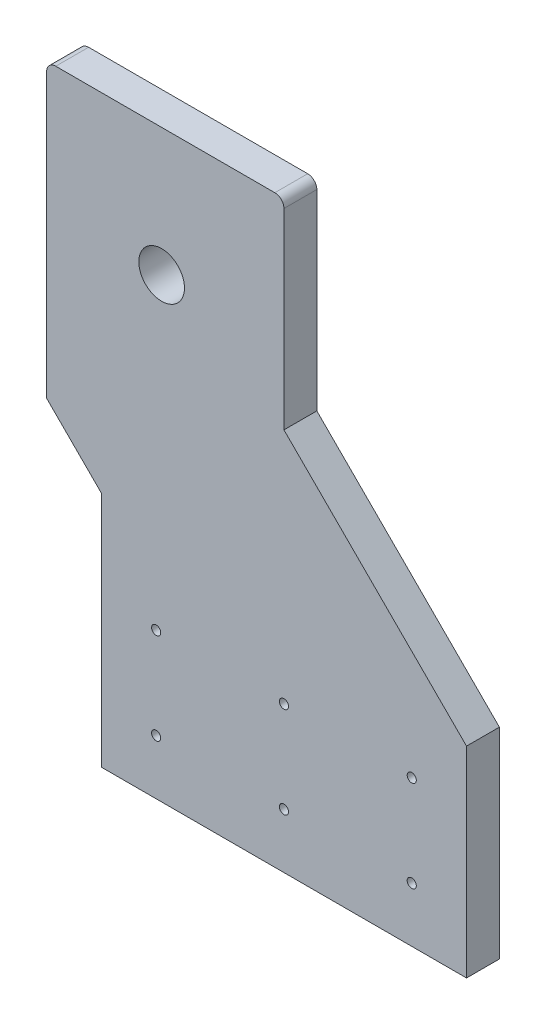
ISO-10303-21;
HEADER;
FILE_DESCRIPTION(('STEP AP214'),'2;1');
FILE_NAME('part.step','',(''),(''),'','','');
FILE_SCHEMA(('AUTOMOTIVE_DESIGN { 1 0 10303 214 1 1 1 1 }'));
ENDSEC;
DATA;
#1=APPLICATION_CONTEXT('core data for automotive mechanical design processes');
#2=APPLICATION_PROTOCOL_DEFINITION('international standard','automotive_design',2000,#1);
#3=PRODUCT_CONTEXT('',#1,'mechanical');
#4=PRODUCT('Part','Part','',(#3));
#5=PRODUCT_RELATED_PRODUCT_CATEGORY('part','',(#4));
#6=PRODUCT_DEFINITION_FORMATION('','',#4);
#7=PRODUCT_DEFINITION_CONTEXT('part definition',#1,'design');
#8=PRODUCT_DEFINITION('design','',#6,#7);
#9=PRODUCT_DEFINITION_SHAPE('','',#8);
#10=(LENGTH_UNIT() NAMED_UNIT(*) SI_UNIT(.MILLI.,.METRE.));
#11=(NAMED_UNIT(*) PLANE_ANGLE_UNIT() SI_UNIT($,.RADIAN.));
#12=(NAMED_UNIT(*) SI_UNIT($,.STERADIAN.) SOLID_ANGLE_UNIT());
#13=UNCERTAINTY_MEASURE_WITH_UNIT(LENGTH_MEASURE(1.E-05),#10,'distance_accuracy_value','');
#14=(GEOMETRIC_REPRESENTATION_CONTEXT(3) GLOBAL_UNCERTAINTY_ASSIGNED_CONTEXT((#13)) GLOBAL_UNIT_ASSIGNED_CONTEXT((#10,
#11,#12)) REPRESENTATION_CONTEXT('',''));
#15=CARTESIAN_POINT('',(0.,0.,0.));
#16=DIRECTION('',(0.,0.,1.));
#17=DIRECTION('',(1.,0.,0.));
#18=AXIS2_PLACEMENT_3D('',#15,#16,#17);
#19=CARTESIAN_POINT('',(-120.929818016854,148.487708826966,18.));
#20=DIRECTION('',(0.,0.,1.));
#21=DIRECTION('',(1.,0.,0.));
#22=AXIS2_PLACEMENT_3D('',#19,#20,#21);
#23=PLANE('',#22);
#24=CARTESIAN_POINT('',(74.070181983146,-86.5122911730335,18.));
#25=DIRECTION('',(0.,0.,1.));
#26=DIRECTION('',(1.,0.,0.));
#27=AXIS2_PLACEMENT_3D('',#24,#25,#26);
#28=CIRCLE('',#27,2.5);
#29=CARTESIAN_POINT('',(76.570181983146,-86.5122911730335,18.));
#30=VERTEX_POINT('',#29);
#31=EDGE_CURVE('E247',#30,#30,#28,.T.);
#32=ORIENTED_EDGE('',*,*,#31,.F.);
#33=EDGE_LOOP('',(#32));
#34=FACE_BOUND('',#33,.T.);
#35=CARTESIAN_POINT('',(74.070181983146,-136.512291173034,18.));
#36=DIRECTION('',(0.,0.,1.));
#37=DIRECTION('',(1.,0.,0.));
#38=AXIS2_PLACEMENT_3D('',#35,#36,#37);
#39=CIRCLE('',#38,2.5);
#40=CARTESIAN_POINT('',(76.570181983146,-136.512291173034,18.));
#41=VERTEX_POINT('',#40);
#42=EDGE_CURVE('E241',#41,#41,#39,.T.);
#43=ORIENTED_EDGE('',*,*,#42,.F.);
#44=EDGE_LOOP('',(#43));
#45=FACE_BOUND('',#44,.T.);
#46=CARTESIAN_POINT('',(4.07018198314597,-136.512291173034,18.));
#47=DIRECTION('',(0.,0.,1.));
#48=DIRECTION('',(1.,0.,0.));
#49=AXIS2_PLACEMENT_3D('',#46,#47,#48);
#50=CIRCLE('',#49,2.5);
#51=CARTESIAN_POINT('',(6.57018198314597,-136.512291173034,18.));
#52=VERTEX_POINT('',#51);
#53=EDGE_CURVE('E235',#52,#52,#50,.T.);
#54=ORIENTED_EDGE('',*,*,#53,.F.);
#55=EDGE_LOOP('',(#54));
#56=FACE_BOUND('',#55,.T.);
#57=CARTESIAN_POINT('',(-65.929818016854,-136.512291173034,18.));
#58=DIRECTION('',(0.,0.,1.));
#59=DIRECTION('',(1.,0.,0.));
#60=AXIS2_PLACEMENT_3D('',#57,#58,#59);
#61=CIRCLE('',#60,2.5);
#62=CARTESIAN_POINT('',(-63.429818016854,-136.512291173034,18.));
#63=VERTEX_POINT('',#62);
#64=EDGE_CURVE('E229',#63,#63,#61,.T.);
#65=ORIENTED_EDGE('',*,*,#64,.F.);
#66=EDGE_LOOP('',(#65));
#67=FACE_BOUND('',#66,.T.);
#68=CARTESIAN_POINT('',(-65.929818016854,-86.5122911730335,18.));
#69=DIRECTION('',(0.,0.,1.));
#70=DIRECTION('',(1.,0.,0.));
#71=AXIS2_PLACEMENT_3D('',#68,#69,#70);
#72=CIRCLE('',#71,2.5);
#73=CARTESIAN_POINT('',(-63.429818016854,-86.5122911730335,18.));
#74=VERTEX_POINT('',#73);
#75=EDGE_CURVE('E223',#74,#74,#72,.T.);
#76=ORIENTED_EDGE('',*,*,#75,.F.);
#77=EDGE_LOOP('',(#76));
#78=FACE_BOUND('',#77,.T.);
#79=CARTESIAN_POINT('',(4.07018198314597,-86.5122911730335,18.));
#80=DIRECTION('',(0.,0.,1.));
#81=DIRECTION('',(1.,0.,0.));
#82=AXIS2_PLACEMENT_3D('',#79,#80,#81);
#83=CIRCLE('',#82,2.5);
#84=CARTESIAN_POINT('',(6.57018198314597,-86.5122911730335,18.));
#85=VERTEX_POINT('',#84);
#86=EDGE_CURVE('E217',#85,#85,#83,.T.);
#87=ORIENTED_EDGE('',*,*,#86,.F.);
#88=EDGE_LOOP('',(#87));
#89=FACE_BOUND('',#88,.T.);
#90=DIRECTION('',(0.,1.,0.));
#91=VECTOR('',#90,1.);
#92=CARTESIAN_POINT('',(104.070181983146,-56.5122911730335,18.));
#93=LINE('',#92,#91);
#94=CARTESIAN_POINT('',(104.070181983146,-166.512291173034,18.));
#95=VERTEX_POINT('',#94);
#96=CARTESIAN_POINT('',(104.070181983146,-56.5122911730335,18.));
#97=VERTEX_POINT('',#96);
#98=EDGE_CURVE('E162',#95,#97,#93,.T.);
#99=ORIENTED_EDGE('',*,*,#98,.T.);
#100=DIRECTION('',(-0.707106781186547,0.707106781186547,0.));
#101=VECTOR('',#100,1.);
#102=CARTESIAN_POINT('',(4.07018198314597,43.4877088269665,18.));
#103=LINE('',#102,#101);
#104=CARTESIAN_POINT('',(4.07018198314597,43.4877088269665,18.));
#105=VERTEX_POINT('',#104);
#106=EDGE_CURVE('E99',#97,#105,#103,.T.);
#107=ORIENTED_EDGE('',*,*,#106,.T.);
#108=DIRECTION('',(0.,1.,0.));
#109=VECTOR('',#108,1.);
#110=CARTESIAN_POINT('',(4.07018198314596,148.487708826966,18.));
#111=LINE('',#110,#109);
#112=CARTESIAN_POINT('',(4.07018198314596,148.487708826966,18.));
#113=VERTEX_POINT('',#112);
#114=EDGE_CURVE('E183',#105,#113,#111,.T.);
#115=ORIENTED_EDGE('',*,*,#114,.T.);
#116=CARTESIAN_POINT('',(-0.929818016854045,148.487708826966,18.));
#117=DIRECTION('',(0.,0.,1.));
#118=DIRECTION('',(1.,0.,0.));
#119=AXIS2_PLACEMENT_3D('',#116,#117,#118);
#120=CIRCLE('',#119,5.);
#121=CARTESIAN_POINT('',(-0.929818016854045,153.487708826966,18.));
#122=VERTEX_POINT('',#121);
#123=EDGE_CURVE('E201',#113,#122,#120,.T.);
#124=ORIENTED_EDGE('',*,*,#123,.T.);
#125=DIRECTION('',(-1.,0.,0.));
#126=VECTOR('',#125,1.);
#127=CARTESIAN_POINT('',(-95.9298180168541,153.487708826966,18.));
#128=LINE('',#127,#126);
#129=CARTESIAN_POINT('',(-120.929818016854,153.487708826966,18.));
#130=VERTEX_POINT('',#129);
#131=EDGE_CURVE('E198',#122,#130,#128,.T.);
#132=ORIENTED_EDGE('',*,*,#131,.T.);
#133=CARTESIAN_POINT('',(-120.929818016854,148.487708826966,18.));
#134=DIRECTION('',(0.,0.,1.));
#135=DIRECTION('',(1.,0.,0.));
#136=AXIS2_PLACEMENT_3D('',#133,#134,#135);
#137=CIRCLE('',#136,5.);
#138=CARTESIAN_POINT('',(-125.929818016854,148.487708826966,18.));
#139=VERTEX_POINT('',#138);
#140=EDGE_CURVE('E200',#130,#139,#137,.T.);
#141=ORIENTED_EDGE('',*,*,#140,.T.);
#142=DIRECTION('',(0.,-1.,0.));
#143=VECTOR('',#142,1.);
#144=CARTESIAN_POINT('',(-125.929818016854,148.487708826966,18.));
#145=LINE('',#144,#143);
#146=CARTESIAN_POINT('',(-125.929818016854,-6.51229117303351,18.));
#147=VERTEX_POINT('',#146);
#148=EDGE_CURVE('E124',#139,#147,#145,.T.);
#149=ORIENTED_EDGE('',*,*,#148,.T.);
#150=DIRECTION('',(0.707106781186547,-0.707106781186548,0.));
#151=VECTOR('',#150,1.);
#152=CARTESIAN_POINT('',(-125.929818016854,-6.51229117303351,18.));
#153=LINE('',#152,#151);
#154=CARTESIAN_POINT('',(-95.929818016854,-36.5122911730335,18.));
#155=VERTEX_POINT('',#154);
#156=EDGE_CURVE('E118',#147,#155,#153,.T.);
#157=ORIENTED_EDGE('',*,*,#156,.T.);
#158=DIRECTION('',(0.,-1.,0.));
#159=VECTOR('',#158,1.);
#160=CARTESIAN_POINT('',(-95.929818016854,-36.5122911730335,18.));
#161=LINE('',#160,#159);
#162=CARTESIAN_POINT('',(-95.929818016854,-166.512291173034,18.));
#163=VERTEX_POINT('',#162);
#164=EDGE_CURVE('E122',#155,#163,#161,.T.);
#165=ORIENTED_EDGE('',*,*,#164,.T.);
#166=DIRECTION('',(1.,0.,0.));
#167=VECTOR('',#166,1.);
#168=CARTESIAN_POINT('',(-95.929818016854,-166.512291173034,18.));
#169=LINE('',#168,#167);
#170=EDGE_CURVE('E50',#163,#95,#169,.T.);
#171=ORIENTED_EDGE('',*,*,#170,.T.);
#172=EDGE_LOOP('',(#99,#107,#115,#124,#132,#141,#149,#157,#165,#171));
#173=FACE_BOUND('',#172,.T.);
#174=CARTESIAN_POINT('',(-62.929818016854,83.4877088269665,18.));
#175=DIRECTION('',(0.,0.,1.));
#176=DIRECTION('',(1.,0.,0.));
#177=AXIS2_PLACEMENT_3D('',#174,#175,#176);
#178=CIRCLE('',#177,12.5);
#179=CARTESIAN_POINT('',(-50.429818016854,83.4877088269665,18.));
#180=VERTEX_POINT('',#179);
#181=EDGE_CURVE('E146',#180,#180,#178,.T.);
#182=ORIENTED_EDGE('',*,*,#181,.F.);
#183=EDGE_LOOP('',(#182));
#184=FACE_BOUND('',#183,.T.);
#185=ADVANCED_FACE('F33',(#34,#45,#56,#67,#78,#89,#173,#184),#23,.T.);
#186=CARTESIAN_POINT('',(-120.929818016854,148.487708826966,0.));
#187=DIRECTION('',(0.,0.,1.));
#188=DIRECTION('',(1.,0.,0.));
#189=AXIS2_PLACEMENT_3D('',#186,#187,#188);
#190=PLANE('',#189);
#191=CARTESIAN_POINT('',(74.070181983146,-86.5122911730335,0.));
#192=DIRECTION('',(0.,0.,1.));
#193=DIRECTION('',(1.,0.,0.));
#194=AXIS2_PLACEMENT_3D('',#191,#192,#193);
#195=CIRCLE('',#194,2.5);
#196=CARTESIAN_POINT('',(76.570181983146,-86.5122911730335,0.));
#197=VERTEX_POINT('',#196);
#198=EDGE_CURVE('E244',#197,#197,#195,.T.);
#199=ORIENTED_EDGE('',*,*,#198,.T.);
#200=EDGE_LOOP('',(#199));
#201=FACE_BOUND('',#200,.T.);
#202=CARTESIAN_POINT('',(74.070181983146,-136.512291173034,0.));
#203=DIRECTION('',(0.,0.,1.));
#204=DIRECTION('',(1.,0.,0.));
#205=AXIS2_PLACEMENT_3D('',#202,#203,#204);
#206=CIRCLE('',#205,2.5);
#207=CARTESIAN_POINT('',(76.570181983146,-136.512291173034,0.));
#208=VERTEX_POINT('',#207);
#209=EDGE_CURVE('E238',#208,#208,#206,.T.);
#210=ORIENTED_EDGE('',*,*,#209,.T.);
#211=EDGE_LOOP('',(#210));
#212=FACE_BOUND('',#211,.T.);
#213=CARTESIAN_POINT('',(4.07018198314597,-136.512291173034,0.));
#214=DIRECTION('',(0.,0.,1.));
#215=DIRECTION('',(1.,0.,0.));
#216=AXIS2_PLACEMENT_3D('',#213,#214,#215);
#217=CIRCLE('',#216,2.5);
#218=CARTESIAN_POINT('',(6.57018198314597,-136.512291173034,0.));
#219=VERTEX_POINT('',#218);
#220=EDGE_CURVE('E232',#219,#219,#217,.T.);
#221=ORIENTED_EDGE('',*,*,#220,.T.);
#222=EDGE_LOOP('',(#221));
#223=FACE_BOUND('',#222,.T.);
#224=CARTESIAN_POINT('',(-65.929818016854,-136.512291173034,0.));
#225=DIRECTION('',(0.,0.,1.));
#226=DIRECTION('',(1.,0.,0.));
#227=AXIS2_PLACEMENT_3D('',#224,#225,#226);
#228=CIRCLE('',#227,2.5);
#229=CARTESIAN_POINT('',(-63.429818016854,-136.512291173034,0.));
#230=VERTEX_POINT('',#229);
#231=EDGE_CURVE('E226',#230,#230,#228,.T.);
#232=ORIENTED_EDGE('',*,*,#231,.T.);
#233=EDGE_LOOP('',(#232));
#234=FACE_BOUND('',#233,.T.);
#235=CARTESIAN_POINT('',(-65.929818016854,-86.5122911730335,0.));
#236=DIRECTION('',(0.,0.,1.));
#237=DIRECTION('',(1.,0.,0.));
#238=AXIS2_PLACEMENT_3D('',#235,#236,#237);
#239=CIRCLE('',#238,2.5);
#240=CARTESIAN_POINT('',(-63.429818016854,-86.5122911730335,0.));
#241=VERTEX_POINT('',#240);
#242=EDGE_CURVE('E220',#241,#241,#239,.T.);
#243=ORIENTED_EDGE('',*,*,#242,.T.);
#244=EDGE_LOOP('',(#243));
#245=FACE_BOUND('',#244,.T.);
#246=CARTESIAN_POINT('',(4.07018198314597,-86.5122911730335,0.));
#247=DIRECTION('',(0.,0.,1.));
#248=DIRECTION('',(1.,0.,0.));
#249=AXIS2_PLACEMENT_3D('',#246,#247,#248);
#250=CIRCLE('',#249,2.5);
#251=CARTESIAN_POINT('',(6.57018198314597,-86.5122911730335,0.));
#252=VERTEX_POINT('',#251);
#253=EDGE_CURVE('E212',#252,#252,#250,.T.);
#254=ORIENTED_EDGE('',*,*,#253,.T.);
#255=EDGE_LOOP('',(#254));
#256=FACE_BOUND('',#255,.T.);
#257=DIRECTION('',(0.,1.,0.));
#258=VECTOR('',#257,1.);
#259=CARTESIAN_POINT('',(104.070181983146,-56.5122911730335,0.));
#260=LINE('',#259,#258);
#261=CARTESIAN_POINT('',(104.070181983146,-166.512291173034,0.));
#262=VERTEX_POINT('',#261);
#263=CARTESIAN_POINT('',(104.070181983146,-56.5122911730335,0.));
#264=VERTEX_POINT('',#263);
#265=EDGE_CURVE('E142',#262,#264,#260,.T.);
#266=ORIENTED_EDGE('',*,*,#265,.F.);
#267=DIRECTION('',(1.,0.,0.));
#268=VECTOR('',#267,1.);
#269=CARTESIAN_POINT('',(-95.929818016854,-166.512291173034,0.));
#270=LINE('',#269,#268);
#271=CARTESIAN_POINT('',(-95.929818016854,-166.512291173034,0.));
#272=VERTEX_POINT('',#271);
#273=EDGE_CURVE('E91',#272,#262,#270,.T.);
#274=ORIENTED_EDGE('',*,*,#273,.F.);
#275=DIRECTION('',(0.,-1.,0.));
#276=VECTOR('',#275,1.);
#277=CARTESIAN_POINT('',(-95.929818016854,-36.5122911730335,0.));
#278=LINE('',#277,#276);
#279=CARTESIAN_POINT('',(-95.929818016854,-36.5122911730335,0.));
#280=VERTEX_POINT('',#279);
#281=EDGE_CURVE('E85',#280,#272,#278,.T.);
#282=ORIENTED_EDGE('',*,*,#281,.F.);
#283=DIRECTION('',(0.707106781186547,-0.707106781186548,0.));
#284=VECTOR('',#283,1.);
#285=CARTESIAN_POINT('',(-125.929818016854,-6.51229117303351,0.));
#286=LINE('',#285,#284);
#287=CARTESIAN_POINT('',(-125.929818016854,-6.51229117303351,0.));
#288=VERTEX_POINT('',#287);
#289=EDGE_CURVE('E132',#288,#280,#286,.T.);
#290=ORIENTED_EDGE('',*,*,#289,.F.);
#291=DIRECTION('',(0.,-1.,0.));
#292=VECTOR('',#291,1.);
#293=CARTESIAN_POINT('',(-125.929818016854,148.487708826966,0.));
#294=LINE('',#293,#292);
#295=CARTESIAN_POINT('',(-125.929818016854,148.487708826966,0.));
#296=VERTEX_POINT('',#295);
#297=EDGE_CURVE('E157',#296,#288,#294,.T.);
#298=ORIENTED_EDGE('',*,*,#297,.F.);
#299=CARTESIAN_POINT('',(-120.929818016854,148.487708826966,0.));
#300=DIRECTION('',(0.,0.,1.));
#301=DIRECTION('',(1.,0.,0.));
#302=AXIS2_PLACEMENT_3D('',#299,#300,#301);
#303=CIRCLE('',#302,5.);
#304=CARTESIAN_POINT('',(-120.929818016854,153.487708826966,0.));
#305=VERTEX_POINT('',#304);
#306=EDGE_CURVE('E155',#305,#296,#303,.T.);
#307=ORIENTED_EDGE('',*,*,#306,.F.);
#308=DIRECTION('',(-1.,0.,0.));
#309=VECTOR('',#308,1.);
#310=CARTESIAN_POINT('',(-95.9298180168541,153.487708826966,0.));
#311=LINE('',#310,#309);
#312=CARTESIAN_POINT('',(-0.929818016854045,153.487708826966,0.));
#313=VERTEX_POINT('',#312);
#314=EDGE_CURVE('E153',#313,#305,#311,.T.);
#315=ORIENTED_EDGE('',*,*,#314,.F.);
#316=CARTESIAN_POINT('',(-0.929818016854045,148.487708826966,0.));
#317=DIRECTION('',(0.,0.,1.));
#318=DIRECTION('',(1.,0.,0.));
#319=AXIS2_PLACEMENT_3D('',#316,#317,#318);
#320=CIRCLE('',#319,5.);
#321=CARTESIAN_POINT('',(4.07018198314596,148.487708826966,0.));
#322=VERTEX_POINT('',#321);
#323=EDGE_CURVE('E150',#322,#313,#320,.T.);
#324=ORIENTED_EDGE('',*,*,#323,.F.);
#325=DIRECTION('',(0.,1.,0.));
#326=VECTOR('',#325,1.);
#327=CARTESIAN_POINT('',(4.07018198314596,148.487708826966,0.));
#328=LINE('',#327,#326);
#329=CARTESIAN_POINT('',(4.07018198314597,43.4877088269665,0.));
#330=VERTEX_POINT('',#329);
#331=EDGE_CURVE('E148',#330,#322,#328,.T.);
#332=ORIENTED_EDGE('',*,*,#331,.F.);
#333=DIRECTION('',(-0.707106781186547,0.707106781186547,0.));
#334=VECTOR('',#333,1.);
#335=CARTESIAN_POINT('',(4.07018198314597,43.4877088269665,0.));
#336=LINE('',#335,#334);
#337=EDGE_CURVE('E145',#264,#330,#336,.T.);
#338=ORIENTED_EDGE('',*,*,#337,.F.);
#339=EDGE_LOOP('',(#266,#274,#282,#290,#298,#307,#315,#324,#332,#338));
#340=FACE_BOUND('',#339,.T.);
#341=CARTESIAN_POINT('',(-62.929818016854,83.4877088269665,0.));
#342=DIRECTION('',(0.,0.,1.));
#343=DIRECTION('',(1.,0.,0.));
#344=AXIS2_PLACEMENT_3D('',#341,#342,#343);
#345=CIRCLE('',#344,12.5);
#346=CARTESIAN_POINT('',(-50.429818016854,83.4877088269665,0.));
#347=VERTEX_POINT('',#346);
#348=EDGE_CURVE('E209',#347,#347,#345,.T.);
#349=ORIENTED_EDGE('',*,*,#348,.T.);
#350=EDGE_LOOP('',(#349));
#351=FACE_BOUND('',#350,.T.);
#352=ADVANCED_FACE('F187',(#201,#212,#223,#234,#245,#256,#340,#351),#190,.F.);
#353=CARTESIAN_POINT('',(104.070181983146,-56.5122911730335,18.));
#354=DIRECTION('',(-1.,0.,0.));
#355=DIRECTION('',(0.,0.,1.));
#356=AXIS2_PLACEMENT_3D('',#353,#354,#355);
#357=PLANE('',#356);
#358=ORIENTED_EDGE('',*,*,#265,.T.);
#359=DIRECTION('',(0.,0.,-1.));
#360=VECTOR('',#359,1.);
#361=CARTESIAN_POINT('',(104.070181983146,-56.5122911730335,18.));
#362=LINE('',#361,#360);
#363=EDGE_CURVE('E11',#97,#264,#362,.T.);
#364=ORIENTED_EDGE('',*,*,#363,.F.);
#365=ORIENTED_EDGE('',*,*,#98,.F.);
#366=DIRECTION('',(0.,0.,-1.));
#367=VECTOR('',#366,1.);
#368=CARTESIAN_POINT('',(104.070181983146,-166.512291173034,18.));
#369=LINE('',#368,#367);
#370=EDGE_CURVE('E138',#95,#262,#369,.T.);
#371=ORIENTED_EDGE('',*,*,#370,.T.);
#372=EDGE_LOOP('',(#358,#364,#365,#371));
#373=FACE_BOUND('',#372,.T.);
#374=ADVANCED_FACE('F35',(#373),#357,.F.);
#375=CARTESIAN_POINT('',(4.07018198314597,43.4877088269665,18.));
#376=DIRECTION('',(-0.707106781186547,-0.707106781186547,0.));
#377=DIRECTION('',(0.707106781186548,-0.707106781186548,0.));
#378=AXIS2_PLACEMENT_3D('',#375,#376,#377);
#379=PLANE('',#378);
#380=ORIENTED_EDGE('',*,*,#337,.T.);
#381=DIRECTION('',(0.,0.,-1.));
#382=VECTOR('',#381,1.);
#383=CARTESIAN_POINT('',(4.07018198314597,43.4877088269665,18.));
#384=LINE('',#383,#382);
#385=EDGE_CURVE('E42',#105,#330,#384,.T.);
#386=ORIENTED_EDGE('',*,*,#385,.F.);
#387=ORIENTED_EDGE('',*,*,#106,.F.);
#388=ORIENTED_EDGE('',*,*,#363,.T.);
#389=EDGE_LOOP('',(#380,#386,#387,#388));
#390=FACE_BOUND('',#389,.T.);
#391=ADVANCED_FACE('F307',(#390),#379,.F.);
#392=CARTESIAN_POINT('',(4.07018198314596,148.487708826966,18.));
#393=DIRECTION('',(-1.,0.,0.));
#394=DIRECTION('',(0.,-1.,0.));
#395=AXIS2_PLACEMENT_3D('',#392,#393,#394);
#396=PLANE('',#395);
#397=ORIENTED_EDGE('',*,*,#331,.T.);
#398=DIRECTION('',(0.,0.,-1.));
#399=VECTOR('',#398,1.);
#400=CARTESIAN_POINT('',(4.07018198314596,148.487708826966,18.));
#401=LINE('',#400,#399);
#402=EDGE_CURVE('E175',#113,#322,#401,.T.);
#403=ORIENTED_EDGE('',*,*,#402,.F.);
#404=ORIENTED_EDGE('',*,*,#114,.F.);
#405=ORIENTED_EDGE('',*,*,#385,.T.);
#406=EDGE_LOOP('',(#397,#403,#404,#405));
#407=FACE_BOUND('',#406,.T.);
#408=ADVANCED_FACE('F181',(#407),#396,.F.);
#409=CARTESIAN_POINT('',(-0.929818016854045,148.487708826966,18.));
#410=DIRECTION('',(0.,0.,-1.));
#411=DIRECTION('',(-1.,0.,0.));
#412=AXIS2_PLACEMENT_3D('',#409,#410,#411);
#413=CYLINDRICAL_SURFACE('',#412,5.);
#414=ORIENTED_EDGE('',*,*,#323,.T.);
#415=DIRECTION('',(0.,0.,-1.));
#416=VECTOR('',#415,1.);
#417=CARTESIAN_POINT('',(-0.929818016854045,153.487708826966,18.));
#418=LINE('',#417,#416);
#419=EDGE_CURVE('E172',#122,#313,#418,.T.);
#420=ORIENTED_EDGE('',*,*,#419,.F.);
#421=ORIENTED_EDGE('',*,*,#123,.F.);
#422=ORIENTED_EDGE('',*,*,#402,.T.);
#423=EDGE_LOOP('',(#414,#420,#421,#422));
#424=FACE_BOUND('',#423,.T.);
#425=ADVANCED_FACE('F192',(#424),#413,.T.);
#426=CARTESIAN_POINT('',(-95.9298180168541,153.487708826966,18.));
#427=DIRECTION('',(0.,-1.,0.));
#428=DIRECTION('',(0.,0.,-1.));
#429=AXIS2_PLACEMENT_3D('',#426,#427,#428);
#430=PLANE('',#429);
#431=ORIENTED_EDGE('',*,*,#314,.T.);
#432=DIRECTION('',(0.,0.,-1.));
#433=VECTOR('',#432,1.);
#434=CARTESIAN_POINT('',(-120.929818016854,153.487708826966,18.));
#435=LINE('',#434,#433);
#436=EDGE_CURVE('E169',#130,#305,#435,.T.);
#437=ORIENTED_EDGE('',*,*,#436,.F.);
#438=ORIENTED_EDGE('',*,*,#131,.F.);
#439=ORIENTED_EDGE('',*,*,#419,.T.);
#440=EDGE_LOOP('',(#431,#437,#438,#439));
#441=FACE_BOUND('',#440,.T.);
#442=ADVANCED_FACE('F196',(#441),#430,.F.);
#443=CARTESIAN_POINT('',(-120.929818016854,148.487708826966,18.));
#444=DIRECTION('',(0.,0.,-1.));
#445=DIRECTION('',(-1.,0.,0.));
#446=AXIS2_PLACEMENT_3D('',#443,#444,#445);
#447=CYLINDRICAL_SURFACE('',#446,5.);
#448=ORIENTED_EDGE('',*,*,#306,.T.);
#449=DIRECTION('',(0.,0.,-1.));
#450=VECTOR('',#449,1.);
#451=CARTESIAN_POINT('',(-125.929818016854,148.487708826966,18.));
#452=LINE('',#451,#450);
#453=EDGE_CURVE('E166',#139,#296,#452,.T.);
#454=ORIENTED_EDGE('',*,*,#453,.F.);
#455=ORIENTED_EDGE('',*,*,#140,.F.);
#456=ORIENTED_EDGE('',*,*,#436,.T.);
#457=EDGE_LOOP('',(#448,#454,#455,#456));
#458=FACE_BOUND('',#457,.T.);
#459=ADVANCED_FACE('F297',(#458),#447,.T.);
#460=CARTESIAN_POINT('',(-125.929818016854,148.487708826966,18.));
#461=DIRECTION('',(1.,0.,0.));
#462=DIRECTION('',(0.,0.,-1.));
#463=AXIS2_PLACEMENT_3D('',#460,#461,#462);
#464=PLANE('',#463);
#465=ORIENTED_EDGE('',*,*,#297,.T.);
#466=DIRECTION('',(0.,0.,-1.));
#467=VECTOR('',#466,1.);
#468=CARTESIAN_POINT('',(-125.929818016854,-6.51229117303351,18.));
#469=LINE('',#468,#467);
#470=EDGE_CURVE('E133',#147,#288,#469,.T.);
#471=ORIENTED_EDGE('',*,*,#470,.F.);
#472=ORIENTED_EDGE('',*,*,#148,.F.);
#473=ORIENTED_EDGE('',*,*,#453,.T.);
#474=EDGE_LOOP('',(#465,#471,#472,#473));
#475=FACE_BOUND('',#474,.T.);
#476=ADVANCED_FACE('F294',(#475),#464,.F.);
#477=CARTESIAN_POINT('',(-125.929818016854,-6.51229117303351,18.));
#478=DIRECTION('',(0.707106781186548,0.707106781186547,0.));
#479=DIRECTION('',(-0.707106781186547,0.707106781186548,0.));
#480=AXIS2_PLACEMENT_3D('',#477,#478,#479);
#481=PLANE('',#480);
#482=ORIENTED_EDGE('',*,*,#289,.T.);
#483=DIRECTION('',(0.,0.,-1.));
#484=VECTOR('',#483,1.);
#485=CARTESIAN_POINT('',(-95.929818016854,-36.5122911730335,18.));
#486=LINE('',#485,#484);
#487=EDGE_CURVE('E129',#155,#280,#486,.T.);
#488=ORIENTED_EDGE('',*,*,#487,.F.);
#489=ORIENTED_EDGE('',*,*,#156,.F.);
#490=ORIENTED_EDGE('',*,*,#470,.T.);
#491=EDGE_LOOP('',(#482,#488,#489,#490));
#492=FACE_BOUND('',#491,.T.);
#493=ADVANCED_FACE('F130',(#492),#481,.F.);
#494=CARTESIAN_POINT('',(-95.929818016854,-36.5122911730335,18.));
#495=DIRECTION('',(1.,0.,0.));
#496=DIRECTION('',(0.,0.,-1.));
#497=AXIS2_PLACEMENT_3D('',#494,#495,#496);
#498=PLANE('',#497);
#499=ORIENTED_EDGE('',*,*,#281,.T.);
#500=DIRECTION('',(0.,0.,-1.));
#501=VECTOR('',#500,1.);
#502=CARTESIAN_POINT('',(-95.929818016854,-166.512291173034,18.));
#503=LINE('',#502,#501);
#504=EDGE_CURVE('E134',#163,#272,#503,.T.);
#505=ORIENTED_EDGE('',*,*,#504,.F.);
#506=ORIENTED_EDGE('',*,*,#164,.F.);
#507=ORIENTED_EDGE('',*,*,#487,.T.);
#508=EDGE_LOOP('',(#499,#505,#506,#507));
#509=FACE_BOUND('',#508,.T.);
#510=ADVANCED_FACE('F136',(#509),#498,.F.);
#511=CARTESIAN_POINT('',(-95.929818016854,-166.512291173034,18.));
#512=DIRECTION('',(0.,1.,0.));
#513=DIRECTION('',(0.,0.,1.));
#514=AXIS2_PLACEMENT_3D('',#511,#512,#513);
#515=PLANE('',#514);
#516=ORIENTED_EDGE('',*,*,#273,.T.);
#517=ORIENTED_EDGE('',*,*,#370,.F.);
#518=ORIENTED_EDGE('',*,*,#170,.F.);
#519=ORIENTED_EDGE('',*,*,#504,.T.);
#520=EDGE_LOOP('',(#516,#517,#518,#519));
#521=FACE_BOUND('',#520,.T.);
#522=ADVANCED_FACE('F279',(#521),#515,.F.);
#523=CARTESIAN_POINT('',(-62.929818016854,83.4877088269665,18.));
#524=DIRECTION('',(0.,0.,-1.));
#525=DIRECTION('',(-1.,0.,0.));
#526=AXIS2_PLACEMENT_3D('',#523,#524,#525);
#527=CYLINDRICAL_SURFACE('',#526,12.5);
#528=ORIENTED_EDGE('',*,*,#181,.T.);
#529=EDGE_LOOP('',(#528));
#530=FACE_BOUND('',#529,.T.);
#531=ORIENTED_EDGE('',*,*,#348,.F.);
#532=EDGE_LOOP('',(#531));
#533=FACE_BOUND('',#532,.T.);
#534=ADVANCED_FACE('F269',(#530,#533),#527,.F.);
#535=CARTESIAN_POINT('',(4.07018198314597,-86.5122911730335,18.));
#536=DIRECTION('',(0.,0.,1.));
#537=DIRECTION('',(1.,0.,0.));
#538=AXIS2_PLACEMENT_3D('',#535,#536,#537);
#539=CYLINDRICAL_SURFACE('',#538,2.5);
#540=ORIENTED_EDGE('',*,*,#253,.F.);
#541=EDGE_LOOP('',(#540));
#542=FACE_BOUND('',#541,.T.);
#543=ORIENTED_EDGE('',*,*,#86,.T.);
#544=EDGE_LOOP('',(#543));
#545=FACE_BOUND('',#544,.T.);
#546=ADVANCED_FACE('F266',(#542,#545),#539,.F.);
#547=CARTESIAN_POINT('',(-65.929818016854,-86.5122911730335,18.));
#548=DIRECTION('',(0.,0.,1.));
#549=DIRECTION('',(1.,0.,0.));
#550=AXIS2_PLACEMENT_3D('',#547,#548,#549);
#551=CYLINDRICAL_SURFACE('',#550,2.5);
#552=ORIENTED_EDGE('',*,*,#242,.F.);
#553=EDGE_LOOP('',(#552));
#554=FACE_BOUND('',#553,.T.);
#555=ORIENTED_EDGE('',*,*,#75,.T.);
#556=EDGE_LOOP('',(#555));
#557=FACE_BOUND('',#556,.T.);
#558=ADVANCED_FACE('F268',(#554,#557),#551,.F.);
#559=CARTESIAN_POINT('',(-65.929818016854,-136.512291173034,18.));
#560=DIRECTION('',(0.,0.,1.));
#561=DIRECTION('',(1.,0.,0.));
#562=AXIS2_PLACEMENT_3D('',#559,#560,#561);
#563=CYLINDRICAL_SURFACE('',#562,2.5);
#564=ORIENTED_EDGE('',*,*,#231,.F.);
#565=EDGE_LOOP('',(#564));
#566=FACE_BOUND('',#565,.T.);
#567=ORIENTED_EDGE('',*,*,#64,.T.);
#568=EDGE_LOOP('',(#567));
#569=FACE_BOUND('',#568,.T.);
#570=ADVANCED_FACE('F276',(#566,#569),#563,.F.);
#571=CARTESIAN_POINT('',(4.07018198314597,-136.512291173034,18.));
#572=DIRECTION('',(0.,0.,1.));
#573=DIRECTION('',(1.,0.,0.));
#574=AXIS2_PLACEMENT_3D('',#571,#572,#573);
#575=CYLINDRICAL_SURFACE('',#574,2.5);
#576=ORIENTED_EDGE('',*,*,#220,.F.);
#577=EDGE_LOOP('',(#576));
#578=FACE_BOUND('',#577,.T.);
#579=ORIENTED_EDGE('',*,*,#53,.T.);
#580=EDGE_LOOP('',(#579));
#581=FACE_BOUND('',#580,.T.);
#582=ADVANCED_FACE('F411',(#578,#581),#575,.F.);
#583=CARTESIAN_POINT('',(74.070181983146,-136.512291173034,18.));
#584=DIRECTION('',(0.,0.,1.));
#585=DIRECTION('',(1.,0.,0.));
#586=AXIS2_PLACEMENT_3D('',#583,#584,#585);
#587=CYLINDRICAL_SURFACE('',#586,2.5);
#588=ORIENTED_EDGE('',*,*,#209,.F.);
#589=EDGE_LOOP('',(#588));
#590=FACE_BOUND('',#589,.T.);
#591=ORIENTED_EDGE('',*,*,#42,.T.);
#592=EDGE_LOOP('',(#591));
#593=FACE_BOUND('',#592,.T.);
#594=ADVANCED_FACE('F419',(#590,#593),#587,.F.);
#595=CARTESIAN_POINT('',(74.070181983146,-86.5122911730335,18.));
#596=DIRECTION('',(0.,0.,1.));
#597=DIRECTION('',(1.,0.,0.));
#598=AXIS2_PLACEMENT_3D('',#595,#596,#597);
#599=CYLINDRICAL_SURFACE('',#598,2.5);
#600=ORIENTED_EDGE('',*,*,#198,.F.);
#601=EDGE_LOOP('',(#600));
#602=FACE_BOUND('',#601,.T.);
#603=ORIENTED_EDGE('',*,*,#31,.T.);
#604=EDGE_LOOP('',(#603));
#605=FACE_BOUND('',#604,.T.);
#606=ADVANCED_FACE('F251',(#602,#605),#599,.F.);
#607=CLOSED_SHELL('',(#185,#352,#374,#391,#408,#425,#442,#459,#476,#493,#510,#522,#534,#546,
#558,#570,#582,#594,#606));
#608=MANIFOLD_SOLID_BREP('B2',#607);
#609=ADVANCED_BREP_SHAPE_REPRESENTATION('',(#18,#608),#14);
#610=SHAPE_DEFINITION_REPRESENTATION(#9,#609);
ENDSEC;
END-ISO-10303-21;
